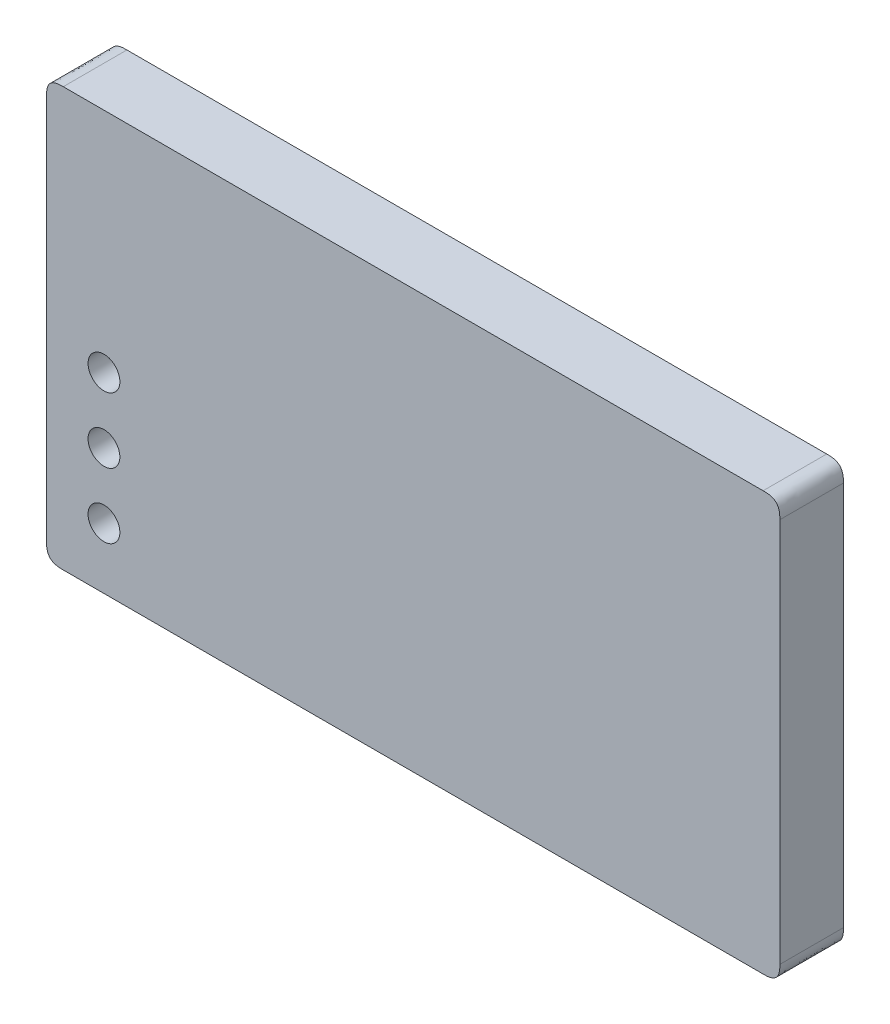
ISO-10303-21;
HEADER;
FILE_DESCRIPTION(('STEP AP214'),'2;1');
FILE_NAME('part.step','',(''),(''),'','','');
FILE_SCHEMA(('AUTOMOTIVE_DESIGN { 1 0 10303 214 1 1 1 1 }'));
ENDSEC;
DATA;
#1=APPLICATION_CONTEXT('core data for automotive mechanical design processes');
#2=APPLICATION_PROTOCOL_DEFINITION('international standard','automotive_design',2000,#1);
#3=PRODUCT_CONTEXT('',#1,'mechanical');
#4=PRODUCT('Part','Part','',(#3));
#5=PRODUCT_RELATED_PRODUCT_CATEGORY('part','',(#4));
#6=PRODUCT_DEFINITION_FORMATION('','',#4);
#7=PRODUCT_DEFINITION_CONTEXT('part definition',#1,'design');
#8=PRODUCT_DEFINITION('design','',#6,#7);
#9=PRODUCT_DEFINITION_SHAPE('','',#8);
#10=(LENGTH_UNIT() NAMED_UNIT(*) SI_UNIT(.MILLI.,.METRE.));
#11=(NAMED_UNIT(*) PLANE_ANGLE_UNIT() SI_UNIT($,.RADIAN.));
#12=(NAMED_UNIT(*) SI_UNIT($,.STERADIAN.) SOLID_ANGLE_UNIT());
#13=UNCERTAINTY_MEASURE_WITH_UNIT(LENGTH_MEASURE(1.E-05),#10,'distance_accuracy_value','');
#14=(GEOMETRIC_REPRESENTATION_CONTEXT(3) GLOBAL_UNCERTAINTY_ASSIGNED_CONTEXT((#13)) GLOBAL_UNIT_ASSIGNED_CONTEXT((#10,
#11,#12)) REPRESENTATION_CONTEXT('',''));
#15=CARTESIAN_POINT('',(0.,0.,0.));
#16=DIRECTION('',(0.,0.,1.));
#17=DIRECTION('',(1.,0.,0.));
#18=AXIS2_PLACEMENT_3D('',#15,#16,#17);
#19=CARTESIAN_POINT('',(0.,0.,19.));
#20=DIRECTION('',(-1.,0.,0.));
#21=DIRECTION('',(0.,0.,1.));
#22=AXIS2_PLACEMENT_3D('',#19,#20,#21);
#23=PLANE('',#22);
#24=DIRECTION('',(0.,1.,0.));
#25=VECTOR('',#24,1.);
#26=CARTESIAN_POINT('',(0.,0.,19.));
#27=LINE('',#26,#25);
#28=CARTESIAN_POINT('',(0.,5.,19.));
#29=VERTEX_POINT('',#28);
#30=CARTESIAN_POINT('',(0.,120.,19.));
#31=VERTEX_POINT('',#30);
#32=EDGE_CURVE('E185',#29,#31,#27,.T.);
#33=ORIENTED_EDGE('',*,*,#32,.T.);
#34=CARTESIAN_POINT('',(0.,120.,-0.95));
#35=CARTESIAN_POINT('',(0.,120.,6.01666666666667));
#36=CARTESIAN_POINT('',(0.,120.,12.9833333333144));
#37=CARTESIAN_POINT('',(0.,120.,19.95));
#38=B_SPLINE_CURVE_WITH_KNOTS('',3,(#34,#35,#36,#37),.UNSPECIFIED.,.F.,.F.,(4,4),
(-0.000949999999999999,0.01995),.UNSPECIFIED.);
#39=CARTESIAN_POINT('',(0.,120.,0.));
#40=VERTEX_POINT('',#39);
#41=EDGE_CURVE('E493',#31,#40,#38,.F.);
#42=ORIENTED_EDGE('',*,*,#41,.T.);
#43=DIRECTION('',(0.,1.,0.));
#44=VECTOR('',#43,1.);
#45=CARTESIAN_POINT('',(0.,0.,0.));
#46=LINE('',#45,#44);
#47=CARTESIAN_POINT('',(0.,5.,0.));
#48=VERTEX_POINT('',#47);
#49=EDGE_CURVE('E176',#48,#40,#46,.T.);
#50=ORIENTED_EDGE('',*,*,#49,.F.);
#51=CARTESIAN_POINT('',(0.,5.,19.95));
#52=CARTESIAN_POINT('',(0.,5.,12.9833333333265));
#53=CARTESIAN_POINT('',(0.,5.,6.01666666666667));
#54=CARTESIAN_POINT('',(0.,5.,-0.95));
#55=B_SPLINE_CURVE_WITH_KNOTS('',3,(#51,#52,#53,#54),.UNSPECIFIED.,.F.,.F.,(4,4),(-0.01995,
0.000949999999999999),.UNSPECIFIED.);
#56=EDGE_CURVE('E197',#48,#29,#55,.F.);
#57=ORIENTED_EDGE('',*,*,#56,.T.);
#58=EDGE_LOOP('',(#33,#42,#50,#57));
#59=FACE_BOUND('',#58,.T.);
#60=ADVANCED_FACE('F35',(#59),#23,.T.);
#61=CARTESIAN_POINT('',(0.,0.,19.));
#62=DIRECTION('',(0.,1.,0.));
#63=DIRECTION('',(0.,0.,1.));
#64=AXIS2_PLACEMENT_3D('',#61,#62,#63);
#65=PLANE('',#64);
#66=DIRECTION('',(1.,0.,0.));
#67=VECTOR('',#66,1.);
#68=CARTESIAN_POINT('',(0.,0.,19.));
#69=LINE('',#68,#67);
#70=CARTESIAN_POINT('',(4.99999999999999,0.,19.));
#71=VERTEX_POINT('',#70);
#72=CARTESIAN_POINT('',(214.,0.,19.));
#73=VERTEX_POINT('',#72);
#74=EDGE_CURVE('E254',#71,#73,#69,.T.);
#75=ORIENTED_EDGE('',*,*,#74,.F.);
#76=CARTESIAN_POINT('',(5.,0.,-0.95));
#77=CARTESIAN_POINT('',(5.,0.,6.01666666666667));
#78=CARTESIAN_POINT('',(5.,0.,12.9833333333265));
#79=CARTESIAN_POINT('',(5.,0.,19.95));
#80=B_SPLINE_CURVE_WITH_KNOTS('',3,(#76,#77,#78,#79),.UNSPECIFIED.,.F.,.F.,(4,4),(-0.01995,
0.00095),.UNSPECIFIED.);
#81=CARTESIAN_POINT('',(5.,0.,0.));
#82=VERTEX_POINT('',#81);
#83=EDGE_CURVE('E49',#71,#82,#80,.F.);
#84=ORIENTED_EDGE('',*,*,#83,.T.);
#85=DIRECTION('',(1.,0.,0.));
#86=VECTOR('',#85,1.);
#87=CARTESIAN_POINT('',(0.,0.,0.));
#88=LINE('',#87,#86);
#89=CARTESIAN_POINT('',(214.,0.,0.));
#90=VERTEX_POINT('',#89);
#91=EDGE_CURVE('E190',#82,#90,#88,.T.);
#92=ORIENTED_EDGE('',*,*,#91,.T.);
#93=CARTESIAN_POINT('',(214.,0.,19.95));
#94=CARTESIAN_POINT('',(214.,0.,12.9833333333144));
#95=CARTESIAN_POINT('',(214.,0.,6.01666666666667));
#96=CARTESIAN_POINT('',(214.,0.,-0.95));
#97=B_SPLINE_CURVE_WITH_KNOTS('',3,(#93,#94,#95,#96),.UNSPECIFIED.,.F.,.F.,(4,4),(-0.00095,
0.01995),.UNSPECIFIED.);
#98=EDGE_CURVE('E354',#90,#73,#97,.F.);
#99=ORIENTED_EDGE('',*,*,#98,.T.);
#100=EDGE_LOOP('',(#75,#84,#92,#99));
#101=FACE_BOUND('',#100,.T.);
#102=ADVANCED_FACE('F213',(#101),#65,.F.);
#103=CARTESIAN_POINT('',(219.,0.,19.));
#104=DIRECTION('',(-1.,0.,0.));
#105=DIRECTION('',(0.,0.,1.));
#106=AXIS2_PLACEMENT_3D('',#103,#104,#105);
#107=PLANE('',#106);
#108=DIRECTION('',(0.,1.,0.));
#109=VECTOR('',#108,1.);
#110=CARTESIAN_POINT('',(219.,0.,0.));
#111=LINE('',#110,#109);
#112=CARTESIAN_POINT('',(219.,5.,0.));
#113=VERTEX_POINT('',#112);
#114=CARTESIAN_POINT('',(219.,120.,0.));
#115=VERTEX_POINT('',#114);
#116=EDGE_CURVE('E234',#113,#115,#111,.T.);
#117=ORIENTED_EDGE('',*,*,#116,.T.);
#118=CARTESIAN_POINT('',(219.,120.,19.95));
#119=CARTESIAN_POINT('',(219.,120.,12.9833333333265));
#120=CARTESIAN_POINT('',(219.,120.,6.01666666666667));
#121=CARTESIAN_POINT('',(219.,120.,-0.95));
#122=B_SPLINE_CURVE_WITH_KNOTS('',3,(#118,#119,#120,#121),.UNSPECIFIED.,.F.,.F.,(4,4),(-0.01995,
0.000949999999999999),.UNSPECIFIED.);
#123=CARTESIAN_POINT('',(219.,120.,19.));
#124=VERTEX_POINT('',#123);
#125=EDGE_CURVE('E11',#115,#124,#122,.F.);
#126=ORIENTED_EDGE('',*,*,#125,.T.);
#127=DIRECTION('',(0.,1.,0.));
#128=VECTOR('',#127,1.);
#129=CARTESIAN_POINT('',(219.,0.,19.));
#130=LINE('',#129,#128);
#131=CARTESIAN_POINT('',(219.,5.,19.));
#132=VERTEX_POINT('',#131);
#133=EDGE_CURVE('E252',#132,#124,#130,.T.);
#134=ORIENTED_EDGE('',*,*,#133,.F.);
#135=CARTESIAN_POINT('',(219.,5.,-0.95));
#136=CARTESIAN_POINT('',(219.,5.,6.01666666666667));
#137=CARTESIAN_POINT('',(219.,5.,12.9833333333144));
#138=CARTESIAN_POINT('',(219.,5.,19.95));
#139=B_SPLINE_CURVE_WITH_KNOTS('',3,(#135,#136,#137,#138),.UNSPECIFIED.,.F.,.F.,(4,4),
(-0.000949999999999999,0.01995),.UNSPECIFIED.);
#140=EDGE_CURVE('E264',#132,#113,#139,.F.);
#141=ORIENTED_EDGE('',*,*,#140,.T.);
#142=EDGE_LOOP('',(#117,#126,#134,#141));
#143=FACE_BOUND('',#142,.T.);
#144=ADVANCED_FACE('F334',(#143),#107,.F.);
#145=CARTESIAN_POINT('',(0.,125.,19.));
#146=DIRECTION('',(0.,1.,0.));
#147=DIRECTION('',(0.,0.,1.));
#148=AXIS2_PLACEMENT_3D('',#145,#146,#147);
#149=PLANE('',#148);
#150=DIRECTION('',(1.,0.,0.));
#151=VECTOR('',#150,1.);
#152=CARTESIAN_POINT('',(0.,125.,0.));
#153=LINE('',#152,#151);
#154=CARTESIAN_POINT('',(5.,125.,0.));
#155=VERTEX_POINT('',#154);
#156=CARTESIAN_POINT('',(214.,125.,0.));
#157=VERTEX_POINT('',#156);
#158=EDGE_CURVE('E235',#155,#157,#153,.T.);
#159=ORIENTED_EDGE('',*,*,#158,.F.);
#160=CARTESIAN_POINT('',(5.,125.,19.95));
#161=CARTESIAN_POINT('',(5.,125.,12.9833333333144));
#162=CARTESIAN_POINT('',(5.,125.,6.01666666666667));
#163=CARTESIAN_POINT('',(5.,125.,-0.95));
#164=B_SPLINE_CURVE_WITH_KNOTS('',3,(#160,#161,#162,#163),.UNSPECIFIED.,.F.,.F.,(4,4),(-0.00095,
0.01995),.UNSPECIFIED.);
#165=CARTESIAN_POINT('',(5.,125.,19.));
#166=VERTEX_POINT('',#165);
#167=EDGE_CURVE('E484',#155,#166,#164,.F.);
#168=ORIENTED_EDGE('',*,*,#167,.T.);
#169=DIRECTION('',(1.,0.,0.));
#170=VECTOR('',#169,1.);
#171=CARTESIAN_POINT('',(0.,125.,19.));
#172=LINE('',#171,#170);
#173=CARTESIAN_POINT('',(214.,125.,19.));
#174=VERTEX_POINT('',#173);
#175=EDGE_CURVE('E189',#166,#174,#172,.T.);
#176=ORIENTED_EDGE('',*,*,#175,.T.);
#177=CARTESIAN_POINT('',(214.,125.,-0.95));
#178=CARTESIAN_POINT('',(214.,125.,6.01666666666667));
#179=CARTESIAN_POINT('',(214.,125.,12.9833333333265));
#180=CARTESIAN_POINT('',(214.,125.,19.95));
#181=B_SPLINE_CURVE_WITH_KNOTS('',3,(#177,#178,#179,#180),.UNSPECIFIED.,.F.,.F.,(4,4),(-0.01995,
0.00095),.UNSPECIFIED.);
#182=EDGE_CURVE('E428',#174,#157,#181,.F.);
#183=ORIENTED_EDGE('',*,*,#182,.T.);
#184=EDGE_LOOP('',(#159,#168,#176,#183));
#185=FACE_BOUND('',#184,.T.);
#186=ADVANCED_FACE('F214',(#185),#149,.T.);
#187=CARTESIAN_POINT('',(0.,0.,19.));
#188=DIRECTION('',(0.,0.,-1.));
#189=DIRECTION('',(-1.,0.,0.));
#190=AXIS2_PLACEMENT_3D('',#187,#188,#189);
#191=PLANE('',#190);
#192=CARTESIAN_POINT('',(17.15,57.15,19.));
#193=DIRECTION('',(0.,0.,1.));
#194=DIRECTION('',(1.,0.,0.));
#195=AXIS2_PLACEMENT_3D('',#192,#193,#194);
#196=CIRCLE('',#195,4.75000000000001);
#197=CARTESIAN_POINT('',(21.9,57.15,19.));
#198=VERTEX_POINT('',#197);
#199=EDGE_CURVE('E246',#198,#198,#196,.T.);
#200=ORIENTED_EDGE('',*,*,#199,.F.);
#201=EDGE_LOOP('',(#200));
#202=FACE_BOUND('',#201,.T.);
#203=CARTESIAN_POINT('',(17.15,37.65,19.));
#204=DIRECTION('',(0.,0.,1.));
#205=DIRECTION('',(1.,0.,0.));
#206=AXIS2_PLACEMENT_3D('',#203,#204,#205);
#207=CIRCLE('',#206,4.75000000000001);
#208=CARTESIAN_POINT('',(21.9,37.65,19.));
#209=VERTEX_POINT('',#208);
#210=EDGE_CURVE('E691',#209,#209,#207,.T.);
#211=ORIENTED_EDGE('',*,*,#210,.F.);
#212=EDGE_LOOP('',(#211));
#213=FACE_BOUND('',#212,.T.);
#214=CARTESIAN_POINT('',(17.15,18.15,19.));
#215=DIRECTION('',(0.,0.,1.));
#216=DIRECTION('',(1.,0.,0.));
#217=AXIS2_PLACEMENT_3D('',#214,#215,#216);
#218=CIRCLE('',#217,4.75000000000001);
#219=CARTESIAN_POINT('',(21.9,18.15,19.));
#220=VERTEX_POINT('',#219);
#221=EDGE_CURVE('E163',#220,#220,#218,.T.);
#222=ORIENTED_EDGE('',*,*,#221,.F.);
#223=EDGE_LOOP('',(#222));
#224=FACE_BOUND('',#223,.T.);
#225=ORIENTED_EDGE('',*,*,#175,.F.);
#226=CARTESIAN_POINT('',(0.,120.,19.));
#227=CARTESIAN_POINT('',(0.,120.84099025767,19.));
#228=CARTESIAN_POINT('',(0.,121.681980515339,19.));
#229=CARTESIAN_POINT('',(0.358459599180418,123.535533905933,19.));
#230=CARTESIAN_POINT('',(1.46446609406726,124.64154040082,19.));
#231=CARTESIAN_POINT('',(3.31801948466053,125.,19.));
#232=CARTESIAN_POINT('',(4.15900974233026,125.,19.));
#233=CARTESIAN_POINT('',(5.,125.,19.));
#234=B_SPLINE_CURVE_WITH_KNOTS('',5,(#226,#227,#228,#229,#230,#231,#232,#233),.UNSPECIFIED.,.F.,
.F.,(6,2,6),(0.,0.5,1.),.UNSPECIFIED.);
#235=EDGE_CURVE('E310',#166,#31,#234,.F.);
#236=ORIENTED_EDGE('',*,*,#235,.T.);
#237=ORIENTED_EDGE('',*,*,#32,.F.);
#238=CARTESIAN_POINT('',(5.,0.,19.));
#239=CARTESIAN_POINT('',(4.15900974233027,0.,19.));
#240=CARTESIAN_POINT('',(3.31801948466054,0.,19.));
#241=CARTESIAN_POINT('',(1.46446609406726,0.358459599180416,19.));
#242=CARTESIAN_POINT('',(0.358459599180416,1.46446609406726,19.));
#243=CARTESIAN_POINT('',(0.,3.31801948466054,19.));
#244=CARTESIAN_POINT('',(0.,4.15900974233027,19.));
#245=CARTESIAN_POINT('',(0.,5.,19.));
#246=B_SPLINE_CURVE_WITH_KNOTS('',5,(#238,#239,#240,#241,#242,#243,#244,#245),.UNSPECIFIED.,.F.,
.F.,(6,2,6),(0.,0.5,1.),.UNSPECIFIED.);
#247=EDGE_CURVE('E63',#29,#71,#246,.F.);
#248=ORIENTED_EDGE('',*,*,#247,.T.);
#249=ORIENTED_EDGE('',*,*,#74,.T.);
#250=CARTESIAN_POINT('',(219.,5.,19.));
#251=CARTESIAN_POINT('',(219.,4.15900974233026,19.));
#252=CARTESIAN_POINT('',(219.,3.31801948466053,19.));
#253=CARTESIAN_POINT('',(218.64154040082,1.46446609406726,19.));
#254=CARTESIAN_POINT('',(217.535533905933,0.358459599180417,19.));
#255=CARTESIAN_POINT('',(215.681980515339,0.,19.));
#256=CARTESIAN_POINT('',(214.84099025767,0.,19.));
#257=CARTESIAN_POINT('',(214.,0.,19.));
#258=B_SPLINE_CURVE_WITH_KNOTS('',5,(#250,#251,#252,#253,#254,#255,#256,#257),.UNSPECIFIED.,.F.,
.F.,(6,2,6),(0.,0.5,1.),.UNSPECIFIED.);
#259=EDGE_CURVE('E349',#73,#132,#258,.F.);
#260=ORIENTED_EDGE('',*,*,#259,.T.);
#261=ORIENTED_EDGE('',*,*,#133,.T.);
#262=CARTESIAN_POINT('',(214.,125.,19.));
#263=CARTESIAN_POINT('',(214.84099025767,125.,19.));
#264=CARTESIAN_POINT('',(215.681980515339,125.,19.));
#265=CARTESIAN_POINT('',(217.535533905933,124.64154040082,19.));
#266=CARTESIAN_POINT('',(218.64154040082,123.535533905933,19.));
#267=CARTESIAN_POINT('',(219.,121.681980515339,19.));
#268=CARTESIAN_POINT('',(219.,120.84099025767,19.));
#269=CARTESIAN_POINT('',(219.,120.,19.));
#270=B_SPLINE_CURVE_WITH_KNOTS('',5,(#262,#263,#264,#265,#266,#267,#268,#269),.UNSPECIFIED.,.F.,
.F.,(6,2,6),(0.,0.5,1.),.UNSPECIFIED.);
#271=EDGE_CURVE('E271',#124,#174,#270,.F.);
#272=ORIENTED_EDGE('',*,*,#271,.T.);
#273=EDGE_LOOP('',(#225,#236,#237,#248,#249,#260,#261,#272));
#274=FACE_BOUND('',#273,.T.);
#275=ADVANCED_FACE('F277',(#202,#213,#224,#274),#191,.F.);
#276=CARTESIAN_POINT('',(0.,0.,0.));
#277=DIRECTION('',(0.,0.,-1.));
#278=DIRECTION('',(-1.,0.,0.));
#279=AXIS2_PLACEMENT_3D('',#276,#277,#278);
#280=PLANE('',#279);
#281=DIRECTION('',(0.,-1.,0.));
#282=VECTOR('',#281,1.);
#283=CARTESIAN_POINT('',(216.4,122.4,0.));
#284=LINE('',#283,#282);
#285=CARTESIAN_POINT('',(216.4,122.4,0.));
#286=VERTEX_POINT('',#285);
#287=CARTESIAN_POINT('',(216.4,2.6,0.));
#288=VERTEX_POINT('',#287);
#289=EDGE_CURVE('E140',#286,#288,#284,.T.);
#290=ORIENTED_EDGE('',*,*,#289,.F.);
#291=DIRECTION('',(1.,0.,0.));
#292=VECTOR('',#291,1.);
#293=CARTESIAN_POINT('',(216.4,122.4,0.));
#294=LINE('',#293,#292);
#295=CARTESIAN_POINT('',(2.59999999999999,122.4,0.));
#296=VERTEX_POINT('',#295);
#297=EDGE_CURVE('E157',#296,#286,#294,.T.);
#298=ORIENTED_EDGE('',*,*,#297,.F.);
#299=DIRECTION('',(0.,1.,0.));
#300=VECTOR('',#299,1.);
#301=CARTESIAN_POINT('',(2.59999999999999,122.4,0.));
#302=LINE('',#301,#300);
#303=CARTESIAN_POINT('',(2.59999999999999,2.6,0.));
#304=VERTEX_POINT('',#303);
#305=EDGE_CURVE('E160',#304,#296,#302,.T.);
#306=ORIENTED_EDGE('',*,*,#305,.F.);
#307=DIRECTION('',(-1.,0.,0.));
#308=VECTOR('',#307,1.);
#309=CARTESIAN_POINT('',(216.4,2.6,0.));
#310=LINE('',#309,#308);
#311=EDGE_CURVE('E169',#288,#304,#310,.T.);
#312=ORIENTED_EDGE('',*,*,#311,.F.);
#313=EDGE_LOOP('',(#290,#298,#306,#312));
#314=FACE_BOUND('',#313,.T.);
#315=ORIENTED_EDGE('',*,*,#49,.T.);
#316=CARTESIAN_POINT('',(5.,125.,0.));
#317=CARTESIAN_POINT('',(4.15900974233026,125.,0.));
#318=CARTESIAN_POINT('',(3.31801948466053,125.,0.));
#319=CARTESIAN_POINT('',(1.46446609406726,124.64154040082,0.));
#320=CARTESIAN_POINT('',(0.358459599180418,123.535533905933,0.));
#321=CARTESIAN_POINT('',(0.,121.681980515339,0.));
#322=CARTESIAN_POINT('',(0.,120.84099025767,0.));
#323=CARTESIAN_POINT('',(0.,120.,0.));
#324=B_SPLINE_CURVE_WITH_KNOTS('',5,(#316,#317,#318,#319,#320,#321,#322,#323),.UNSPECIFIED.,.F.,
.F.,(6,2,6),(0.,0.5,1.),.UNSPECIFIED.);
#325=EDGE_CURVE('E488',#40,#155,#324,.F.);
#326=ORIENTED_EDGE('',*,*,#325,.T.);
#327=ORIENTED_EDGE('',*,*,#158,.T.);
#328=CARTESIAN_POINT('',(219.,120.,0.));
#329=CARTESIAN_POINT('',(219.,120.84099025767,0.));
#330=CARTESIAN_POINT('',(219.,121.681980515339,0.));
#331=CARTESIAN_POINT('',(218.64154040082,123.535533905933,0.));
#332=CARTESIAN_POINT('',(217.535533905933,124.64154040082,0.));
#333=CARTESIAN_POINT('',(215.681980515339,125.,0.));
#334=CARTESIAN_POINT('',(214.84099025767,125.,0.));
#335=CARTESIAN_POINT('',(214.,125.,0.));
#336=B_SPLINE_CURVE_WITH_KNOTS('',5,(#328,#329,#330,#331,#332,#333,#334,#335),.UNSPECIFIED.,.F.,
.F.,(6,2,6),(0.,0.5,1.),.UNSPECIFIED.);
#337=EDGE_CURVE('E404',#157,#115,#336,.F.);
#338=ORIENTED_EDGE('',*,*,#337,.T.);
#339=ORIENTED_EDGE('',*,*,#116,.F.);
#340=CARTESIAN_POINT('',(214.,0.,0.));
#341=CARTESIAN_POINT('',(214.84099025767,0.,0.));
#342=CARTESIAN_POINT('',(215.681980515339,0.,0.));
#343=CARTESIAN_POINT('',(217.535533905933,0.358459599180417,0.));
#344=CARTESIAN_POINT('',(218.64154040082,1.46446609406726,0.));
#345=CARTESIAN_POINT('',(219.,3.31801948466053,0.));
#346=CARTESIAN_POINT('',(219.,4.15900974233026,0.));
#347=CARTESIAN_POINT('',(219.,5.,0.));
#348=B_SPLINE_CURVE_WITH_KNOTS('',5,(#340,#341,#342,#343,#344,#345,#346,#347),.UNSPECIFIED.,.F.,
.F.,(6,2,6),(0.,0.5,1.),.UNSPECIFIED.);
#349=EDGE_CURVE('E358',#113,#90,#348,.F.);
#350=ORIENTED_EDGE('',*,*,#349,.T.);
#351=ORIENTED_EDGE('',*,*,#91,.F.);
#352=CARTESIAN_POINT('',(0.,5.,0.));
#353=CARTESIAN_POINT('',(0.,4.15900974233027,0.));
#354=CARTESIAN_POINT('',(0.,3.31801948466054,0.));
#355=CARTESIAN_POINT('',(0.358459599180416,1.46446609406726,0.));
#356=CARTESIAN_POINT('',(1.46446609406726,0.358459599180416,0.));
#357=CARTESIAN_POINT('',(3.31801948466054,0.,0.));
#358=CARTESIAN_POINT('',(4.15900974233027,0.,0.));
#359=CARTESIAN_POINT('',(5.,0.,0.));
#360=B_SPLINE_CURVE_WITH_KNOTS('',5,(#352,#353,#354,#355,#356,#357,#358,#359),.UNSPECIFIED.,.F.,
.F.,(6,2,6),(0.,0.5,1.),.UNSPECIFIED.);
#361=EDGE_CURVE('E490',#82,#48,#360,.F.);
#362=ORIENTED_EDGE('',*,*,#361,.T.);
#363=EDGE_LOOP('',(#315,#326,#327,#338,#339,#350,#351,#362));
#364=FACE_BOUND('',#363,.T.);
#365=ADVANCED_FACE('F287',(#314,#364),#280,.T.);
#366=CARTESIAN_POINT('',(216.4,122.4,7.7));
#367=DIRECTION('',(1.,0.,0.));
#368=DIRECTION('',(0.,1.,0.));
#369=AXIS2_PLACEMENT_3D('',#366,#367,#368);
#370=PLANE('',#369);
#371=ORIENTED_EDGE('',*,*,#289,.T.);
#372=DIRECTION('',(0.,0.,-1.));
#373=VECTOR('',#372,1.);
#374=CARTESIAN_POINT('',(216.4,2.6,7.7));
#375=LINE('',#374,#373);
#376=CARTESIAN_POINT('',(216.4,2.6,7.7));
#377=VERTEX_POINT('',#376);
#378=EDGE_CURVE('E133',#377,#288,#375,.T.);
#379=ORIENTED_EDGE('',*,*,#378,.F.);
#380=DIRECTION('',(0.,-1.,0.));
#381=VECTOR('',#380,1.);
#382=CARTESIAN_POINT('',(216.4,122.4,7.7));
#383=LINE('',#382,#381);
#384=CARTESIAN_POINT('',(216.4,122.4,7.7));
#385=VERTEX_POINT('',#384);
#386=EDGE_CURVE('E137',#385,#377,#383,.T.);
#387=ORIENTED_EDGE('',*,*,#386,.F.);
#388=DIRECTION('',(0.,0.,-1.));
#389=VECTOR('',#388,1.);
#390=CARTESIAN_POINT('',(216.4,122.4,7.7));
#391=LINE('',#390,#389);
#392=EDGE_CURVE('E174',#385,#286,#391,.T.);
#393=ORIENTED_EDGE('',*,*,#392,.T.);
#394=EDGE_LOOP('',(#371,#379,#387,#393));
#395=FACE_BOUND('',#394,.T.);
#396=ADVANCED_FACE('F135',(#395),#370,.F.);
#397=CARTESIAN_POINT('',(216.4,122.4,7.7));
#398=DIRECTION('',(0.,1.,0.));
#399=DIRECTION('',(0.,0.,1.));
#400=AXIS2_PLACEMENT_3D('',#397,#398,#399);
#401=PLANE('',#400);
#402=ORIENTED_EDGE('',*,*,#297,.T.);
#403=ORIENTED_EDGE('',*,*,#392,.F.);
#404=DIRECTION('',(1.,0.,0.));
#405=VECTOR('',#404,1.);
#406=CARTESIAN_POINT('',(216.4,122.4,7.7));
#407=LINE('',#406,#405);
#408=CARTESIAN_POINT('',(2.59999999999999,122.4,7.7));
#409=VERTEX_POINT('',#408);
#410=EDGE_CURVE('E145',#409,#385,#407,.T.);
#411=ORIENTED_EDGE('',*,*,#410,.F.);
#412=DIRECTION('',(0.,0.,-1.));
#413=VECTOR('',#412,1.);
#414=CARTESIAN_POINT('',(2.59999999999999,122.4,7.7));
#415=LINE('',#414,#413);
#416=EDGE_CURVE('E177',#409,#296,#415,.T.);
#417=ORIENTED_EDGE('',*,*,#416,.T.);
#418=EDGE_LOOP('',(#402,#403,#411,#417));
#419=FACE_BOUND('',#418,.T.);
#420=ADVANCED_FACE('F564',(#419),#401,.F.);
#421=CARTESIAN_POINT('',(2.59999999999999,122.4,7.7));
#422=DIRECTION('',(-1.,0.,0.));
#423=DIRECTION('',(0.,0.,1.));
#424=AXIS2_PLACEMENT_3D('',#421,#422,#423);
#425=PLANE('',#424);
#426=ORIENTED_EDGE('',*,*,#305,.T.);
#427=ORIENTED_EDGE('',*,*,#416,.F.);
#428=DIRECTION('',(0.,1.,0.));
#429=VECTOR('',#428,1.);
#430=CARTESIAN_POINT('',(2.59999999999999,122.4,7.7));
#431=LINE('',#430,#429);
#432=CARTESIAN_POINT('',(2.59999999999999,2.6,7.7));
#433=VERTEX_POINT('',#432);
#434=EDGE_CURVE('E153',#433,#409,#431,.T.);
#435=ORIENTED_EDGE('',*,*,#434,.F.);
#436=DIRECTION('',(0.,0.,-1.));
#437=VECTOR('',#436,1.);
#438=CARTESIAN_POINT('',(2.59999999999999,2.6,7.7));
#439=LINE('',#438,#437);
#440=EDGE_CURVE('E144',#433,#304,#439,.T.);
#441=ORIENTED_EDGE('',*,*,#440,.T.);
#442=EDGE_LOOP('',(#426,#427,#435,#441));
#443=FACE_BOUND('',#442,.T.);
#444=ADVANCED_FACE('F567',(#443),#425,.F.);
#445=CARTESIAN_POINT('',(216.4,2.6,7.7));
#446=DIRECTION('',(0.,-1.,0.));
#447=DIRECTION('',(1.,0.,0.));
#448=AXIS2_PLACEMENT_3D('',#445,#446,#447);
#449=PLANE('',#448);
#450=ORIENTED_EDGE('',*,*,#311,.T.);
#451=ORIENTED_EDGE('',*,*,#440,.F.);
#452=DIRECTION('',(-1.,0.,0.));
#453=VECTOR('',#452,1.);
#454=CARTESIAN_POINT('',(216.4,2.6,7.7));
#455=LINE('',#454,#453);
#456=EDGE_CURVE('E148',#377,#433,#455,.T.);
#457=ORIENTED_EDGE('',*,*,#456,.F.);
#458=ORIENTED_EDGE('',*,*,#378,.T.);
#459=EDGE_LOOP('',(#450,#451,#457,#458));
#460=FACE_BOUND('',#459,.T.);
#461=ADVANCED_FACE('F149',(#460),#449,.F.);
#462=CARTESIAN_POINT('',(0.,0.,7.7));
#463=DIRECTION('',(0.,0.,-1.));
#464=DIRECTION('',(-1.,0.,0.));
#465=AXIS2_PLACEMENT_3D('',#462,#463,#464);
#466=PLANE('',#465);
#467=CARTESIAN_POINT('',(17.15,57.15,7.7));
#468=DIRECTION('',(0.,0.,-1.));
#469=DIRECTION('',(-1.,0.,0.));
#470=AXIS2_PLACEMENT_3D('',#467,#468,#469);
#471=CIRCLE('',#470,4.75000000000001);
#472=CARTESIAN_POINT('',(12.4,57.15,7.7));
#473=VERTEX_POINT('',#472);
#474=EDGE_CURVE('E170',#473,#473,#471,.T.);
#475=ORIENTED_EDGE('',*,*,#474,.F.);
#476=EDGE_LOOP('',(#475));
#477=FACE_BOUND('',#476,.T.);
#478=CARTESIAN_POINT('',(17.15,37.65,7.7));
#479=DIRECTION('',(0.,0.,-1.));
#480=DIRECTION('',(-1.,0.,0.));
#481=AXIS2_PLACEMENT_3D('',#478,#479,#480);
#482=CIRCLE('',#481,4.75000000000001);
#483=CARTESIAN_POINT('',(12.4,37.65,7.7));
#484=VERTEX_POINT('',#483);
#485=EDGE_CURVE('E245',#484,#484,#482,.T.);
#486=ORIENTED_EDGE('',*,*,#485,.F.);
#487=EDGE_LOOP('',(#486));
#488=FACE_BOUND('',#487,.T.);
#489=CARTESIAN_POINT('',(17.15,18.15,7.7));
#490=DIRECTION('',(0.,0.,-1.));
#491=DIRECTION('',(-1.,0.,0.));
#492=AXIS2_PLACEMENT_3D('',#489,#490,#491);
#493=CIRCLE('',#492,4.75000000000001);
#494=CARTESIAN_POINT('',(12.4,18.15,7.7));
#495=VERTEX_POINT('',#494);
#496=EDGE_CURVE('E242',#495,#495,#493,.T.);
#497=ORIENTED_EDGE('',*,*,#496,.F.);
#498=EDGE_LOOP('',(#497));
#499=FACE_BOUND('',#498,.T.);
#500=ORIENTED_EDGE('',*,*,#386,.T.);
#501=ORIENTED_EDGE('',*,*,#456,.T.);
#502=ORIENTED_EDGE('',*,*,#434,.T.);
#503=ORIENTED_EDGE('',*,*,#410,.T.);
#504=EDGE_LOOP('',(#500,#501,#502,#503));
#505=FACE_BOUND('',#504,.T.);
#506=ADVANCED_FACE('F155',(#477,#488,#499,#505),#466,.T.);
#507=CARTESIAN_POINT('',(17.15,18.15,0.));
#508=DIRECTION('',(0.,0.,1.));
#509=DIRECTION('',(1.,0.,0.));
#510=AXIS2_PLACEMENT_3D('',#507,#508,#509);
#511=CYLINDRICAL_SURFACE('',#510,4.75000000000001);
#512=ORIENTED_EDGE('',*,*,#496,.T.);
#513=EDGE_LOOP('',(#512));
#514=FACE_BOUND('',#513,.T.);
#515=ORIENTED_EDGE('',*,*,#221,.T.);
#516=EDGE_LOOP('',(#515));
#517=FACE_BOUND('',#516,.T.);
#518=ADVANCED_FACE('F553',(#514,#517),#511,.F.);
#519=CARTESIAN_POINT('',(17.15,37.65,0.));
#520=DIRECTION('',(0.,0.,1.));
#521=DIRECTION('',(1.,0.,0.));
#522=AXIS2_PLACEMENT_3D('',#519,#520,#521);
#523=CYLINDRICAL_SURFACE('',#522,4.75000000000001);
#524=ORIENTED_EDGE('',*,*,#485,.T.);
#525=EDGE_LOOP('',(#524));
#526=FACE_BOUND('',#525,.T.);
#527=ORIENTED_EDGE('',*,*,#210,.T.);
#528=EDGE_LOOP('',(#527));
#529=FACE_BOUND('',#528,.T.);
#530=ADVANCED_FACE('F547',(#526,#529),#523,.F.);
#531=CARTESIAN_POINT('',(17.15,57.15,0.));
#532=DIRECTION('',(0.,0.,1.));
#533=DIRECTION('',(1.,0.,0.));
#534=AXIS2_PLACEMENT_3D('',#531,#532,#533);
#535=CYLINDRICAL_SURFACE('',#534,4.75000000000001);
#536=ORIENTED_EDGE('',*,*,#474,.T.);
#537=EDGE_LOOP('',(#536));
#538=FACE_BOUND('',#537,.T.);
#539=ORIENTED_EDGE('',*,*,#199,.T.);
#540=EDGE_LOOP('',(#539));
#541=FACE_BOUND('',#540,.T.);
#542=ADVANCED_FACE('F543',(#538,#541),#535,.F.);
#543=CARTESIAN_POINT('',(219.,5.,19.95));
#544=CARTESIAN_POINT('',(219.,5.,12.9833333333144));
#545=CARTESIAN_POINT('',(219.,5.,6.01666666666667));
#546=CARTESIAN_POINT('',(219.,5.,-0.95));
#547=CARTESIAN_POINT('',(219.,4.15900974233026,19.95));
#548=CARTESIAN_POINT('',(219.,4.15900974233026,12.9833333333144));
#549=CARTESIAN_POINT('',(219.,4.15900974233026,6.01666666666667));
#550=CARTESIAN_POINT('',(219.,4.15900974233026,-0.95));
#551=CARTESIAN_POINT('',(219.,3.31801948466053,19.95));
#552=CARTESIAN_POINT('',(219.,3.31801948466053,12.9833333333144));
#553=CARTESIAN_POINT('',(219.,3.31801948466053,6.01666666666667));
#554=CARTESIAN_POINT('',(219.,3.31801948466053,-0.95));
#555=CARTESIAN_POINT('',(218.64154040082,1.46446609406726,19.95));
#556=CARTESIAN_POINT('',(218.64154040082,1.46446609406726,12.9833333333144));
#557=CARTESIAN_POINT('',(218.64154040082,1.46446609406726,6.01666666666667));
#558=CARTESIAN_POINT('',(218.64154040082,1.46446609406726,-0.95));
#559=CARTESIAN_POINT('',(217.535533905933,0.358459599180417,19.95));
#560=CARTESIAN_POINT('',(217.535533905933,0.358459599180417,12.9833333333144));
#561=CARTESIAN_POINT('',(217.535533905933,0.358459599180417,6.01666666666667));
#562=CARTESIAN_POINT('',(217.535533905933,0.358459599180417,-0.95));
#563=CARTESIAN_POINT('',(215.681980515339,0.,19.95));
#564=CARTESIAN_POINT('',(215.681980515339,0.,12.9833333333144));
#565=CARTESIAN_POINT('',(215.681980515339,0.,6.01666666666667));
#566=CARTESIAN_POINT('',(215.681980515339,0.,-0.95));
#567=CARTESIAN_POINT('',(214.84099025767,0.,19.95));
#568=CARTESIAN_POINT('',(214.84099025767,0.,12.9833333333144));
#569=CARTESIAN_POINT('',(214.84099025767,0.,6.01666666666667));
#570=CARTESIAN_POINT('',(214.84099025767,0.,-0.95));
#571=CARTESIAN_POINT('',(214.,0.,19.95));
#572=CARTESIAN_POINT('',(214.,0.,12.9833333333144));
#573=CARTESIAN_POINT('',(214.,0.,6.01666666666667));
#574=CARTESIAN_POINT('',(214.,0.,-0.95));
#575=B_SPLINE_SURFACE_WITH_KNOTS('',5,3,((#543,#544,#545,#546),(#547,#548,#549,#550),(#551,#552,
#553,#554),(#555,#556,#557,#558),(#559,#560,#561,#562),(#563,#564,#565,#566),(#567,#568,#569,
#570),(#571,#572,#573,#574)),.UNSPECIFIED.,.F.,.F.,.F.,(6,2,6),(4,4),(0.,0.5,1.),(-0.00095,
0.01995),.UNSPECIFIED.);
#576=ORIENTED_EDGE('',*,*,#259,.F.);
#577=ORIENTED_EDGE('',*,*,#98,.F.);
#578=ORIENTED_EDGE('',*,*,#349,.F.);
#579=ORIENTED_EDGE('',*,*,#140,.F.);
#580=EDGE_LOOP('',(#576,#577,#578,#579));
#581=FACE_BOUND('',#580,.T.);
#582=ADVANCED_FACE('F218',(#581),#575,.T.);
#583=CARTESIAN_POINT('',(0.,120.,19.95));
#584=CARTESIAN_POINT('',(0.,120.,12.9833333333144));
#585=CARTESIAN_POINT('',(0.,120.,6.01666666666667));
#586=CARTESIAN_POINT('',(0.,120.,-0.95));
#587=CARTESIAN_POINT('',(0.,120.84099025767,19.95));
#588=CARTESIAN_POINT('',(0.,120.84099025767,12.9833333333144));
#589=CARTESIAN_POINT('',(0.,120.84099025767,6.01666666666667));
#590=CARTESIAN_POINT('',(0.,120.84099025767,-0.95));
#591=CARTESIAN_POINT('',(0.,121.681980515339,19.95));
#592=CARTESIAN_POINT('',(0.,121.681980515339,12.9833333333144));
#593=CARTESIAN_POINT('',(0.,121.681980515339,6.01666666666667));
#594=CARTESIAN_POINT('',(0.,121.681980515339,-0.95));
#595=CARTESIAN_POINT('',(0.358459599180418,123.535533905933,19.95));
#596=CARTESIAN_POINT('',(0.358459599180418,123.535533905933,12.9833333333144));
#597=CARTESIAN_POINT('',(0.358459599180418,123.535533905933,6.01666666666667));
#598=CARTESIAN_POINT('',(0.358459599180418,123.535533905933,-0.95));
#599=CARTESIAN_POINT('',(1.46446609406726,124.64154040082,19.95));
#600=CARTESIAN_POINT('',(1.46446609406726,124.64154040082,12.9833333333144));
#601=CARTESIAN_POINT('',(1.46446609406726,124.64154040082,6.01666666666667));
#602=CARTESIAN_POINT('',(1.46446609406726,124.64154040082,-0.95));
#603=CARTESIAN_POINT('',(3.31801948466053,125.,19.95));
#604=CARTESIAN_POINT('',(3.31801948466053,125.,12.9833333333144));
#605=CARTESIAN_POINT('',(3.31801948466053,125.,6.01666666666667));
#606=CARTESIAN_POINT('',(3.31801948466053,125.,-0.95));
#607=CARTESIAN_POINT('',(4.15900974233026,125.,19.95));
#608=CARTESIAN_POINT('',(4.15900974233026,125.,12.9833333333144));
#609=CARTESIAN_POINT('',(4.15900974233026,125.,6.01666666666667));
#610=CARTESIAN_POINT('',(4.15900974233026,125.,-0.95));
#611=CARTESIAN_POINT('',(5.,125.,19.95));
#612=CARTESIAN_POINT('',(5.,125.,12.9833333333144));
#613=CARTESIAN_POINT('',(5.,125.,6.01666666666667));
#614=CARTESIAN_POINT('',(5.,125.,-0.95));
#615=B_SPLINE_SURFACE_WITH_KNOTS('',5,3,((#583,#584,#585,#586),(#587,#588,#589,#590),(#591,#592,
#593,#594),(#595,#596,#597,#598),(#599,#600,#601,#602),(#603,#604,#605,#606),(#607,#608,#609,
#610),(#611,#612,#613,#614)),.UNSPECIFIED.,.F.,.F.,.F.,(6,2,6),(4,4),(0.,0.5,1.),(-0.00095,
0.01995),.UNSPECIFIED.);
#616=ORIENTED_EDGE('',*,*,#235,.F.);
#617=ORIENTED_EDGE('',*,*,#167,.F.);
#618=ORIENTED_EDGE('',*,*,#325,.F.);
#619=ORIENTED_EDGE('',*,*,#41,.F.);
#620=EDGE_LOOP('',(#616,#617,#618,#619));
#621=FACE_BOUND('',#620,.T.);
#622=ADVANCED_FACE('F455',(#621),#615,.T.);
#623=CARTESIAN_POINT('',(0.,5.,-0.95));
#624=CARTESIAN_POINT('',(0.,5.,6.01666666666667));
#625=CARTESIAN_POINT('',(0.,5.,12.9833333333265));
#626=CARTESIAN_POINT('',(0.,5.,19.95));
#627=CARTESIAN_POINT('',(0.,4.15900974233027,-0.95));
#628=CARTESIAN_POINT('',(0.,4.15900974233027,6.01666666666667));
#629=CARTESIAN_POINT('',(0.,4.15900974233027,12.9833333333265));
#630=CARTESIAN_POINT('',(0.,4.15900974233027,19.95));
#631=CARTESIAN_POINT('',(0.,3.31801948466054,-0.95));
#632=CARTESIAN_POINT('',(0.,3.31801948466054,6.01666666666667));
#633=CARTESIAN_POINT('',(0.,3.31801948466054,12.9833333333265));
#634=CARTESIAN_POINT('',(0.,3.31801948466054,19.95));
#635=CARTESIAN_POINT('',(0.358459599180416,1.46446609406726,-0.95));
#636=CARTESIAN_POINT('',(0.358459599180416,1.46446609406726,6.01666666666667));
#637=CARTESIAN_POINT('',(0.358459599180416,1.46446609406726,12.9833333333265));
#638=CARTESIAN_POINT('',(0.358459599180416,1.46446609406726,19.95));
#639=CARTESIAN_POINT('',(1.46446609406726,0.358459599180416,-0.95));
#640=CARTESIAN_POINT('',(1.46446609406726,0.358459599180416,6.01666666666667));
#641=CARTESIAN_POINT('',(1.46446609406726,0.358459599180416,12.9833333333265));
#642=CARTESIAN_POINT('',(1.46446609406726,0.358459599180416,19.95));
#643=CARTESIAN_POINT('',(3.31801948466054,0.,-0.95));
#644=CARTESIAN_POINT('',(3.31801948466054,0.,6.01666666666667));
#645=CARTESIAN_POINT('',(3.31801948466054,0.,12.9833333333265));
#646=CARTESIAN_POINT('',(3.31801948466054,0.,19.95));
#647=CARTESIAN_POINT('',(4.15900974233027,0.,-0.95));
#648=CARTESIAN_POINT('',(4.15900974233027,0.,6.01666666666667));
#649=CARTESIAN_POINT('',(4.15900974233027,0.,12.9833333333265));
#650=CARTESIAN_POINT('',(4.15900974233027,0.,19.95));
#651=CARTESIAN_POINT('',(5.,0.,-0.95));
#652=CARTESIAN_POINT('',(5.,0.,6.01666666666667));
#653=CARTESIAN_POINT('',(5.,0.,12.9833333333265));
#654=CARTESIAN_POINT('',(5.,0.,19.95));
#655=B_SPLINE_SURFACE_WITH_KNOTS('',5,3,((#623,#624,#625,#626),(#627,#628,#629,#630),(#631,#632,
#633,#634),(#635,#636,#637,#638),(#639,#640,#641,#642),(#643,#644,#645,#646),(#647,#648,#649,
#650),(#651,#652,#653,#654)),.UNSPECIFIED.,.F.,.F.,.F.,(6,2,6),(4,4),(0.,0.5,1.),(-0.01995,
0.00095),.UNSPECIFIED.);
#656=ORIENTED_EDGE('',*,*,#247,.F.);
#657=ORIENTED_EDGE('',*,*,#56,.F.);
#658=ORIENTED_EDGE('',*,*,#361,.F.);
#659=ORIENTED_EDGE('',*,*,#83,.F.);
#660=EDGE_LOOP('',(#656,#657,#658,#659));
#661=FACE_BOUND('',#660,.T.);
#662=ADVANCED_FACE('F442',(#661),#655,.T.);
#663=CARTESIAN_POINT('',(219.,120.,-0.95));
#664=CARTESIAN_POINT('',(219.,120.,6.01666666666667));
#665=CARTESIAN_POINT('',(219.,120.,12.9833333333265));
#666=CARTESIAN_POINT('',(219.,120.,19.95));
#667=CARTESIAN_POINT('',(219.,120.84099025767,-0.95));
#668=CARTESIAN_POINT('',(219.,120.84099025767,6.01666666666667));
#669=CARTESIAN_POINT('',(219.,120.84099025767,12.9833333333265));
#670=CARTESIAN_POINT('',(219.,120.84099025767,19.95));
#671=CARTESIAN_POINT('',(219.,121.681980515339,-0.95));
#672=CARTESIAN_POINT('',(219.,121.681980515339,6.01666666666667));
#673=CARTESIAN_POINT('',(219.,121.681980515339,12.9833333333265));
#674=CARTESIAN_POINT('',(219.,121.681980515339,19.95));
#675=CARTESIAN_POINT('',(218.64154040082,123.535533905933,-0.95));
#676=CARTESIAN_POINT('',(218.64154040082,123.535533905933,6.01666666666667));
#677=CARTESIAN_POINT('',(218.64154040082,123.535533905933,12.9833333333265));
#678=CARTESIAN_POINT('',(218.64154040082,123.535533905933,19.95));
#679=CARTESIAN_POINT('',(217.535533905933,124.64154040082,-0.95));
#680=CARTESIAN_POINT('',(217.535533905933,124.64154040082,6.01666666666667));
#681=CARTESIAN_POINT('',(217.535533905933,124.64154040082,12.9833333333265));
#682=CARTESIAN_POINT('',(217.535533905933,124.64154040082,19.95));
#683=CARTESIAN_POINT('',(215.681980515339,125.,-0.95));
#684=CARTESIAN_POINT('',(215.681980515339,125.,6.01666666666667));
#685=CARTESIAN_POINT('',(215.681980515339,125.,12.9833333333265));
#686=CARTESIAN_POINT('',(215.681980515339,125.,19.95));
#687=CARTESIAN_POINT('',(214.84099025767,125.,-0.95));
#688=CARTESIAN_POINT('',(214.84099025767,125.,6.01666666666667));
#689=CARTESIAN_POINT('',(214.84099025767,125.,12.9833333333265));
#690=CARTESIAN_POINT('',(214.84099025767,125.,19.95));
#691=CARTESIAN_POINT('',(214.,125.,-0.95));
#692=CARTESIAN_POINT('',(214.,125.,6.01666666666667));
#693=CARTESIAN_POINT('',(214.,125.,12.9833333333265));
#694=CARTESIAN_POINT('',(214.,125.,19.95));
#695=B_SPLINE_SURFACE_WITH_KNOTS('',5,3,((#663,#664,#665,#666),(#667,#668,#669,#670),(#671,#672,
#673,#674),(#675,#676,#677,#678),(#679,#680,#681,#682),(#683,#684,#685,#686),(#687,#688,#689,
#690),(#691,#692,#693,#694)),.UNSPECIFIED.,.F.,.F.,.F.,(6,2,6),(4,4),(0.,0.5,1.),(-0.01995,
0.00095),.UNSPECIFIED.);
#696=ORIENTED_EDGE('',*,*,#271,.F.);
#697=ORIENTED_EDGE('',*,*,#125,.F.);
#698=ORIENTED_EDGE('',*,*,#337,.F.);
#699=ORIENTED_EDGE('',*,*,#182,.F.);
#700=EDGE_LOOP('',(#696,#697,#698,#699));
#701=FACE_BOUND('',#700,.T.);
#702=ADVANCED_FACE('F38',(#701),#695,.T.);
#703=CLOSED_SHELL('',(#60,#102,#144,#186,#275,#365,#396,#420,#444,#461,#506,#518,#530,#542,#582,
#622,#662,#702));
#704=MANIFOLD_SOLID_BREP('B2',#703);
#705=ADVANCED_BREP_SHAPE_REPRESENTATION('',(#18,#704),#14);
#706=SHAPE_DEFINITION_REPRESENTATION(#9,#705);
ENDSEC;
END-ISO-10303-21;
